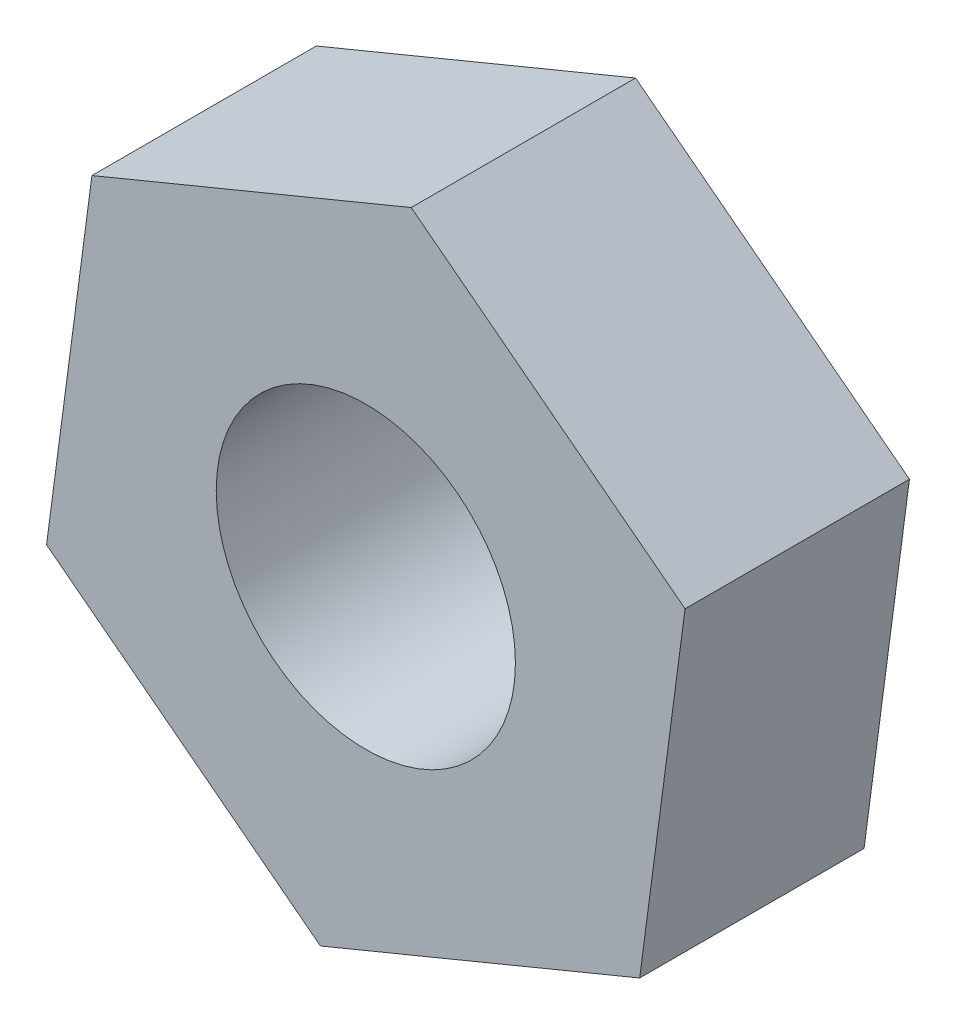
ISO-10303-21;
HEADER;
FILE_DESCRIPTION(('STEP AP214'),'2;1');
FILE_NAME('part.step','',(''),(''),'','','');
FILE_SCHEMA(('AUTOMOTIVE_DESIGN { 1 0 10303 214 1 1 1 1 }'));
ENDSEC;
DATA;
#1=APPLICATION_CONTEXT('core data for automotive mechanical design processes');
#2=APPLICATION_PROTOCOL_DEFINITION('international standard','automotive_design',2000,#1);
#3=PRODUCT_CONTEXT('',#1,'mechanical');
#4=PRODUCT('Part','Part','',(#3));
#5=PRODUCT_RELATED_PRODUCT_CATEGORY('part','',(#4));
#6=PRODUCT_DEFINITION_FORMATION('','',#4);
#7=PRODUCT_DEFINITION_CONTEXT('part definition',#1,'design');
#8=PRODUCT_DEFINITION('design','',#6,#7);
#9=PRODUCT_DEFINITION_SHAPE('','',#8);
#10=(LENGTH_UNIT() NAMED_UNIT(*) SI_UNIT(.MILLI.,.METRE.));
#11=(NAMED_UNIT(*) PLANE_ANGLE_UNIT() SI_UNIT($,.RADIAN.));
#12=(NAMED_UNIT(*) SI_UNIT($,.STERADIAN.) SOLID_ANGLE_UNIT());
#13=UNCERTAINTY_MEASURE_WITH_UNIT(LENGTH_MEASURE(1.E-05),#10,'distance_accuracy_value','');
#14=(GEOMETRIC_REPRESENTATION_CONTEXT(3) GLOBAL_UNCERTAINTY_ASSIGNED_CONTEXT((#13)) GLOBAL_UNIT_ASSIGNED_CONTEXT((#10,
#11,#12)) REPRESENTATION_CONTEXT('',''));
#15=CARTESIAN_POINT('',(0.,0.,0.));
#16=DIRECTION('',(0.,0.,1.));
#17=DIRECTION('',(1.,0.,0.));
#18=AXIS2_PLACEMENT_3D('',#15,#16,#17);
#19=CARTESIAN_POINT('',(0.,0.,1.5));
#20=DIRECTION('',(0.,0.,1.));
#21=DIRECTION('',(1.,0.,0.));
#22=AXIS2_PLACEMENT_3D('',#19,#20,#21);
#23=PLANE('',#22);
#24=DIRECTION('',(0.924211474921771,0.381881067379524,0.));
#25=VECTOR('',#24,1.);
#26=CARTESIAN_POINT('',(-0.303425352909404,-2.28938122394352,1.5));
#27=LINE('',#26,#25);
#28=CARTESIAN_POINT('',(-0.303425352909404,-2.28938122394352,1.5));
#29=VERTEX_POINT('',#28);
#30=CARTESIAN_POINT('',(1.8309496224275,-1.40746467574356,1.5));
#31=VERTEX_POINT('',#30);
#32=EDGE_CURVE('E131',#29,#31,#27,.T.);
#33=ORIENTED_EDGE('',*,*,#32,.T.);
#34=DIRECTION('',(0.131387031885901,0.9913311494411,0.));
#35=VECTOR('',#34,1.);
#36=CARTESIAN_POINT('',(1.8309496224275,-1.40746467574356,1.5));
#37=LINE('',#36,#35);
#38=CARTESIAN_POINT('',(2.1343749753369,0.881916548199959,1.5));
#39=VERTEX_POINT('',#38);
#40=EDGE_CURVE('E89',#31,#39,#37,.T.);
#41=ORIENTED_EDGE('',*,*,#40,.T.);
#42=DIRECTION('',(-0.79282444303587,0.609450082061577,0.));
#43=VECTOR('',#42,1.);
#44=CARTESIAN_POINT('',(2.1343749753369,0.881916548199959,1.5));
#45=LINE('',#44,#43);
#46=CARTESIAN_POINT('',(0.303425352909404,2.28938122394352,1.5));
#47=VERTEX_POINT('',#46);
#48=EDGE_CURVE('E102',#39,#47,#45,.T.);
#49=ORIENTED_EDGE('',*,*,#48,.T.);
#50=DIRECTION('',(-0.924211474921771,-0.381881067379523,0.));
#51=VECTOR('',#50,1.);
#52=CARTESIAN_POINT('',(0.303425352909404,2.28938122394352,1.5));
#53=LINE('',#52,#51);
#54=CARTESIAN_POINT('',(-1.8309496224275,1.40746467574356,1.5));
#55=VERTEX_POINT('',#54);
#56=EDGE_CURVE('E96',#47,#55,#53,.T.);
#57=ORIENTED_EDGE('',*,*,#56,.T.);
#58=DIRECTION('',(-0.131387031885901,-0.9913311494411,0.));
#59=VECTOR('',#58,1.);
#60=CARTESIAN_POINT('',(-1.8309496224275,1.40746467574356,1.5));
#61=LINE('',#60,#59);
#62=CARTESIAN_POINT('',(-2.1343749753369,-0.881916548199959,1.5));
#63=VERTEX_POINT('',#62);
#64=EDGE_CURVE('E100',#55,#63,#61,.T.);
#65=ORIENTED_EDGE('',*,*,#64,.T.);
#66=DIRECTION('',(0.79282444303587,-0.609450082061577,0.));
#67=VECTOR('',#66,1.);
#68=CARTESIAN_POINT('',(-2.1343749753369,-0.881916548199959,1.5));
#69=LINE('',#68,#67);
#70=EDGE_CURVE('E52',#63,#29,#69,.T.);
#71=ORIENTED_EDGE('',*,*,#70,.T.);
#72=EDGE_LOOP('',(#33,#41,#49,#57,#65,#71));
#73=FACE_BOUND('',#72,.T.);
#74=CARTESIAN_POINT('',(0.,0.,1.5));
#75=DIRECTION('',(0.,0.,1.));
#76=DIRECTION('',(1.,0.,0.));
#77=AXIS2_PLACEMENT_3D('',#74,#75,#76);
#78=CIRCLE('',#77,1.);
#79=CARTESIAN_POINT('',(1.,0.,1.5));
#80=VERTEX_POINT('',#79);
#81=EDGE_CURVE('E124',#80,#80,#78,.T.);
#82=ORIENTED_EDGE('',*,*,#81,.F.);
#83=EDGE_LOOP('',(#82));
#84=FACE_BOUND('',#83,.T.);
#85=ADVANCED_FACE('F35',(#73,#84),#23,.T.);
#86=CARTESIAN_POINT('',(0.,0.,0.));
#87=DIRECTION('',(0.,0.,1.));
#88=DIRECTION('',(1.,0.,0.));
#89=AXIS2_PLACEMENT_3D('',#86,#87,#88);
#90=PLANE('',#89);
#91=DIRECTION('',(0.924211474921771,0.381881067379524,0.));
#92=VECTOR('',#91,1.);
#93=CARTESIAN_POINT('',(-0.303425352909404,-2.28938122394352,0.));
#94=LINE('',#93,#92);
#95=CARTESIAN_POINT('',(-0.303425352909404,-2.28938122394352,0.));
#96=VERTEX_POINT('',#95);
#97=CARTESIAN_POINT('',(1.8309496224275,-1.40746467574356,0.));
#98=VERTEX_POINT('',#97);
#99=EDGE_CURVE('E120',#96,#98,#94,.T.);
#100=ORIENTED_EDGE('',*,*,#99,.F.);
#101=DIRECTION('',(0.79282444303587,-0.609450082061577,0.));
#102=VECTOR('',#101,1.);
#103=CARTESIAN_POINT('',(-2.1343749753369,-0.881916548199959,0.));
#104=LINE('',#103,#102);
#105=CARTESIAN_POINT('',(-2.1343749753369,-0.881916548199959,0.));
#106=VERTEX_POINT('',#105);
#107=EDGE_CURVE('E81',#106,#96,#104,.T.);
#108=ORIENTED_EDGE('',*,*,#107,.F.);
#109=DIRECTION('',(-0.131387031885901,-0.9913311494411,0.));
#110=VECTOR('',#109,1.);
#111=CARTESIAN_POINT('',(-1.8309496224275,1.40746467574356,0.));
#112=LINE('',#111,#110);
#113=CARTESIAN_POINT('',(-1.8309496224275,1.40746467574356,0.));
#114=VERTEX_POINT('',#113);
#115=EDGE_CURVE('E75',#114,#106,#112,.T.);
#116=ORIENTED_EDGE('',*,*,#115,.F.);
#117=DIRECTION('',(-0.924211474921771,-0.381881067379523,0.));
#118=VECTOR('',#117,1.);
#119=CARTESIAN_POINT('',(0.303425352909404,2.28938122394352,0.));
#120=LINE('',#119,#118);
#121=CARTESIAN_POINT('',(0.303425352909404,2.28938122394352,0.));
#122=VERTEX_POINT('',#121);
#123=EDGE_CURVE('E110',#122,#114,#120,.T.);
#124=ORIENTED_EDGE('',*,*,#123,.F.);
#125=DIRECTION('',(-0.79282444303587,0.609450082061577,0.));
#126=VECTOR('',#125,1.);
#127=CARTESIAN_POINT('',(2.1343749753369,0.881916548199959,0.));
#128=LINE('',#127,#126);
#129=CARTESIAN_POINT('',(2.1343749753369,0.881916548199959,0.));
#130=VERTEX_POINT('',#129);
#131=EDGE_CURVE('E126',#130,#122,#128,.T.);
#132=ORIENTED_EDGE('',*,*,#131,.F.);
#133=DIRECTION('',(0.131387031885901,0.9913311494411,0.));
#134=VECTOR('',#133,1.);
#135=CARTESIAN_POINT('',(1.8309496224275,-1.40746467574356,0.));
#136=LINE('',#135,#134);
#137=EDGE_CURVE('E123',#98,#130,#136,.T.);
#138=ORIENTED_EDGE('',*,*,#137,.F.);
#139=EDGE_LOOP('',(#100,#108,#116,#124,#132,#138));
#140=FACE_BOUND('',#139,.T.);
#141=CARTESIAN_POINT('',(0.,0.,0.));
#142=DIRECTION('',(0.,0.,1.));
#143=DIRECTION('',(1.,0.,0.));
#144=AXIS2_PLACEMENT_3D('',#141,#142,#143);
#145=CIRCLE('',#144,1.);
#146=CARTESIAN_POINT('',(1.,0.,0.));
#147=VERTEX_POINT('',#146);
#148=EDGE_CURVE('E224',#147,#147,#145,.T.);
#149=ORIENTED_EDGE('',*,*,#148,.T.);
#150=EDGE_LOOP('',(#149));
#151=FACE_BOUND('',#150,.T.);
#152=ADVANCED_FACE('F140',(#140,#151),#90,.F.);
#153=CARTESIAN_POINT('',(-0.303425352909404,-2.28938122394352,1.5));
#154=DIRECTION('',(-0.381881067379524,0.924211474921771,0.));
#155=DIRECTION('',(-0.924211474921771,-0.381881067379524,0.));
#156=AXIS2_PLACEMENT_3D('',#153,#154,#155);
#157=PLANE('',#156);
#158=ORIENTED_EDGE('',*,*,#99,.T.);
#159=DIRECTION('',(0.,0.,-1.));
#160=VECTOR('',#159,1.);
#161=CARTESIAN_POINT('',(1.8309496224275,-1.40746467574356,1.5));
#162=LINE('',#161,#160);
#163=EDGE_CURVE('E11',#31,#98,#162,.T.);
#164=ORIENTED_EDGE('',*,*,#163,.F.);
#165=ORIENTED_EDGE('',*,*,#32,.F.);
#166=DIRECTION('',(0.,0.,-1.));
#167=VECTOR('',#166,1.);
#168=CARTESIAN_POINT('',(-0.303425352909404,-2.28938122394352,1.5));
#169=LINE('',#168,#167);
#170=EDGE_CURVE('E116',#29,#96,#169,.T.);
#171=ORIENTED_EDGE('',*,*,#170,.T.);
#172=EDGE_LOOP('',(#158,#164,#165,#171));
#173=FACE_BOUND('',#172,.T.);
#174=ADVANCED_FACE('F37',(#173),#157,.F.);
#175=CARTESIAN_POINT('',(1.8309496224275,-1.40746467574356,1.5));
#176=DIRECTION('',(-0.9913311494411,0.131387031885901,0.));
#177=DIRECTION('',(-0.131387031885901,-0.9913311494411,0.));
#178=AXIS2_PLACEMENT_3D('',#175,#176,#177);
#179=PLANE('',#178);
#180=ORIENTED_EDGE('',*,*,#137,.T.);
#181=DIRECTION('',(0.,0.,-1.));
#182=VECTOR('',#181,1.);
#183=CARTESIAN_POINT('',(2.1343749753369,0.881916548199959,1.5));
#184=LINE('',#183,#182);
#185=EDGE_CURVE('E44',#39,#130,#184,.T.);
#186=ORIENTED_EDGE('',*,*,#185,.F.);
#187=ORIENTED_EDGE('',*,*,#40,.F.);
#188=ORIENTED_EDGE('',*,*,#163,.T.);
#189=EDGE_LOOP('',(#180,#186,#187,#188));
#190=FACE_BOUND('',#189,.T.);
#191=ADVANCED_FACE('F165',(#190),#179,.F.);
#192=CARTESIAN_POINT('',(2.1343749753369,0.881916548199959,1.5));
#193=DIRECTION('',(-0.609450082061577,-0.79282444303587,0.));
#194=DIRECTION('',(0.79282444303587,-0.609450082061577,0.));
#195=AXIS2_PLACEMENT_3D('',#192,#193,#194);
#196=PLANE('',#195);
#197=ORIENTED_EDGE('',*,*,#131,.T.);
#198=DIRECTION('',(0.,0.,-1.));
#199=VECTOR('',#198,1.);
#200=CARTESIAN_POINT('',(0.303425352909404,2.28938122394352,1.5));
#201=LINE('',#200,#199);
#202=EDGE_CURVE('E111',#47,#122,#201,.T.);
#203=ORIENTED_EDGE('',*,*,#202,.F.);
#204=ORIENTED_EDGE('',*,*,#48,.F.);
#205=ORIENTED_EDGE('',*,*,#185,.T.);
#206=EDGE_LOOP('',(#197,#203,#204,#205));
#207=FACE_BOUND('',#206,.T.);
#208=ADVANCED_FACE('F137',(#207),#196,.F.);
#209=CARTESIAN_POINT('',(0.303425352909404,2.28938122394352,1.5));
#210=DIRECTION('',(0.381881067379523,-0.924211474921771,0.));
#211=DIRECTION('',(0.924211474921771,0.381881067379523,0.));
#212=AXIS2_PLACEMENT_3D('',#209,#210,#211);
#213=PLANE('',#212);
#214=ORIENTED_EDGE('',*,*,#123,.T.);
#215=DIRECTION('',(0.,0.,-1.));
#216=VECTOR('',#215,1.);
#217=CARTESIAN_POINT('',(-1.8309496224275,1.40746467574356,1.5));
#218=LINE('',#217,#216);
#219=EDGE_CURVE('E107',#55,#114,#218,.T.);
#220=ORIENTED_EDGE('',*,*,#219,.F.);
#221=ORIENTED_EDGE('',*,*,#56,.F.);
#222=ORIENTED_EDGE('',*,*,#202,.T.);
#223=EDGE_LOOP('',(#214,#220,#221,#222));
#224=FACE_BOUND('',#223,.T.);
#225=ADVANCED_FACE('F108',(#224),#213,.F.);
#226=CARTESIAN_POINT('',(-1.8309496224275,1.40746467574356,1.5));
#227=DIRECTION('',(0.9913311494411,-0.131387031885901,0.));
#228=DIRECTION('',(0.131387031885901,0.9913311494411,0.));
#229=AXIS2_PLACEMENT_3D('',#226,#227,#228);
#230=PLANE('',#229);
#231=ORIENTED_EDGE('',*,*,#115,.T.);
#232=DIRECTION('',(0.,0.,-1.));
#233=VECTOR('',#232,1.);
#234=CARTESIAN_POINT('',(-2.1343749753369,-0.881916548199959,1.5));
#235=LINE('',#234,#233);
#236=EDGE_CURVE('E112',#63,#106,#235,.T.);
#237=ORIENTED_EDGE('',*,*,#236,.F.);
#238=ORIENTED_EDGE('',*,*,#64,.F.);
#239=ORIENTED_EDGE('',*,*,#219,.T.);
#240=EDGE_LOOP('',(#231,#237,#238,#239));
#241=FACE_BOUND('',#240,.T.);
#242=ADVANCED_FACE('F114',(#241),#230,.F.);
#243=CARTESIAN_POINT('',(-2.1343749753369,-0.881916548199959,1.5));
#244=DIRECTION('',(0.609450082061577,0.79282444303587,0.));
#245=DIRECTION('',(-0.79282444303587,0.609450082061577,0.));
#246=AXIS2_PLACEMENT_3D('',#243,#244,#245);
#247=PLANE('',#246);
#248=ORIENTED_EDGE('',*,*,#107,.T.);
#249=ORIENTED_EDGE('',*,*,#170,.F.);
#250=ORIENTED_EDGE('',*,*,#70,.F.);
#251=ORIENTED_EDGE('',*,*,#236,.T.);
#252=EDGE_LOOP('',(#248,#249,#250,#251));
#253=FACE_BOUND('',#252,.T.);
#254=ADVANCED_FACE('F145',(#253),#247,.F.);
#255=CARTESIAN_POINT('',(0.,0.,1.5));
#256=DIRECTION('',(0.,0.,-1.));
#257=DIRECTION('',(-1.,0.,0.));
#258=AXIS2_PLACEMENT_3D('',#255,#256,#257);
#259=CYLINDRICAL_SURFACE('',#258,1.);
#260=ORIENTED_EDGE('',*,*,#81,.T.);
#261=EDGE_LOOP('',(#260));
#262=FACE_BOUND('',#261,.T.);
#263=ORIENTED_EDGE('',*,*,#148,.F.);
#264=EDGE_LOOP('',(#263));
#265=FACE_BOUND('',#264,.T.);
#266=ADVANCED_FACE('F147',(#262,#265),#259,.F.);
#267=CLOSED_SHELL('',(#85,#152,#174,#191,#208,#225,#242,#254,#266));
#268=MANIFOLD_SOLID_BREP('B2',#267);
#269=ADVANCED_BREP_SHAPE_REPRESENTATION('',(#18,#268),#14);
#270=SHAPE_DEFINITION_REPRESENTATION(#9,#269);
ENDSEC;
END-ISO-10303-21;
